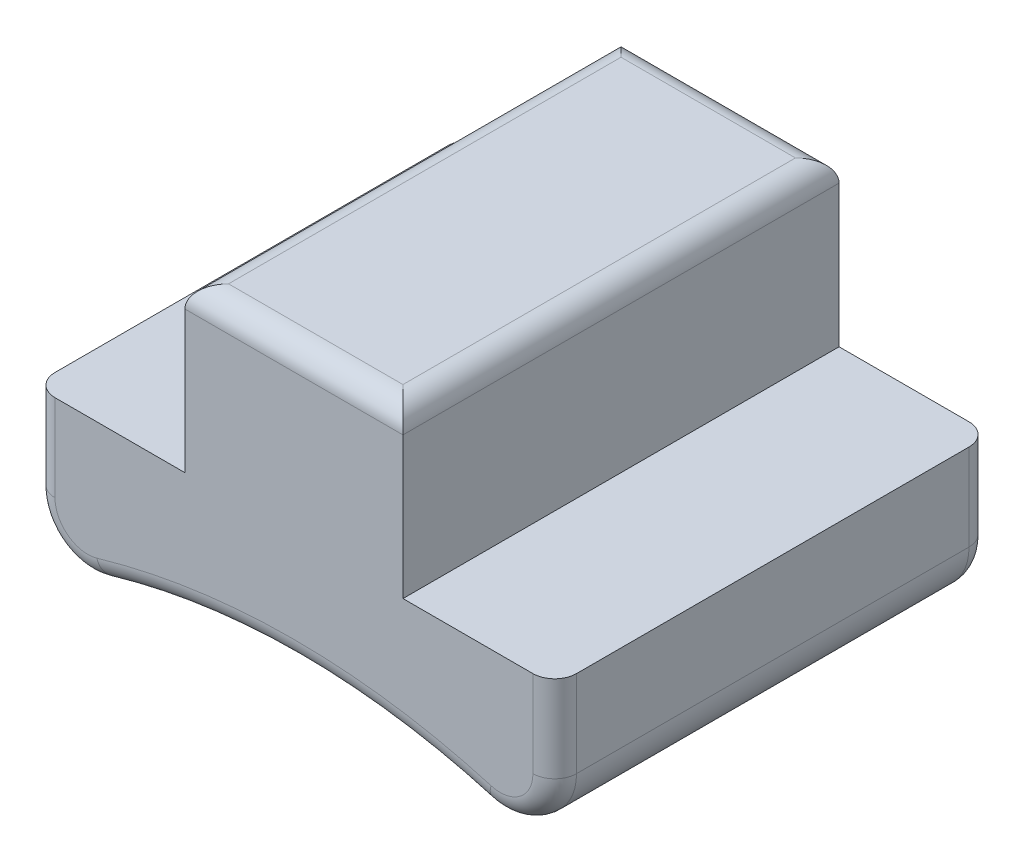
ISO-10303-21;
HEADER;
FILE_DESCRIPTION(('STEP AP214'),'2;1');
FILE_NAME('part.step','',(''),(''),'','','');
FILE_SCHEMA(('AUTOMOTIVE_DESIGN { 1 0 10303 214 1 1 1 1 }'));
ENDSEC;
DATA;
#1=APPLICATION_CONTEXT('core data for automotive mechanical design processes');
#2=APPLICATION_PROTOCOL_DEFINITION('international standard','automotive_design',2000,#1);
#3=PRODUCT_CONTEXT('',#1,'mechanical');
#4=PRODUCT('Part','Part','',(#3));
#5=PRODUCT_RELATED_PRODUCT_CATEGORY('part','',(#4));
#6=PRODUCT_DEFINITION_FORMATION('','',#4);
#7=PRODUCT_DEFINITION_CONTEXT('part definition',#1,'design');
#8=PRODUCT_DEFINITION('design','',#6,#7);
#9=PRODUCT_DEFINITION_SHAPE('','',#8);
#10=(LENGTH_UNIT() NAMED_UNIT(*) SI_UNIT(.MILLI.,.METRE.));
#11=(NAMED_UNIT(*) PLANE_ANGLE_UNIT() SI_UNIT($,.RADIAN.));
#12=(NAMED_UNIT(*) SI_UNIT($,.STERADIAN.) SOLID_ANGLE_UNIT());
#13=UNCERTAINTY_MEASURE_WITH_UNIT(LENGTH_MEASURE(1.E-05),#10,'distance_accuracy_value','');
#14=(GEOMETRIC_REPRESENTATION_CONTEXT(3) GLOBAL_UNCERTAINTY_ASSIGNED_CONTEXT((#13)) GLOBAL_UNIT_ASSIGNED_CONTEXT((#10,
#11,#12)) REPRESENTATION_CONTEXT('',''));
#15=CARTESIAN_POINT('',(0.,0.,0.));
#16=DIRECTION('',(0.,0.,1.));
#17=DIRECTION('',(1.,0.,0.));
#18=AXIS2_PLACEMENT_3D('',#15,#16,#17);
#19=CARTESIAN_POINT('',(-12.7,92.3829378930835,50.8));
#20=DIRECTION('',(0.,-1.,0.));
#21=DIRECTION('',(0.,0.,-1.));
#22=AXIS2_PLACEMENT_3D('',#19,#20,#21);
#23=PLANE('',#22);
#24=DIRECTION('',(-1.,0.,0.));
#25=VECTOR('',#24,1.);
#26=CARTESIAN_POINT('',(-12.7,92.3829378930835,0.));
#27=LINE('',#26,#25);
#28=CARTESIAN_POINT('',(-12.7,92.3829378930835,0.));
#29=VERTEX_POINT('',#28);
#30=CARTESIAN_POINT('',(-27.8354974439788,92.3829378930835,0.));
#31=VERTEX_POINT('',#30);
#32=EDGE_CURVE('E209',#29,#31,#27,.T.);
#33=ORIENTED_EDGE('',*,*,#32,.T.);
#34=CARTESIAN_POINT('',(-27.8354974439788,92.3829378930835,2.54));
#35=DIRECTION('',(0.,-1.,0.));
#36=DIRECTION('',(0.,0.,-1.));
#37=AXIS2_PLACEMENT_3D('',#34,#35,#36);
#38=CIRCLE('',#37,2.54);
#39=CARTESIAN_POINT('',(-30.3754974439788,92.3829378930835,2.54));
#40=VERTEX_POINT('',#39);
#41=EDGE_CURVE('E352',#31,#40,#38,.F.);
#42=ORIENTED_EDGE('',*,*,#41,.T.);
#43=DIRECTION('',(0.,0.,-1.));
#44=VECTOR('',#43,1.);
#45=CARTESIAN_POINT('',(-30.3754974439788,92.3829378930835,50.8));
#46=LINE('',#45,#44);
#47=CARTESIAN_POINT('',(-30.3754974439788,92.3829378930835,48.26));
#48=VERTEX_POINT('',#47);
#49=EDGE_CURVE('E227',#48,#40,#46,.T.);
#50=ORIENTED_EDGE('',*,*,#49,.F.);
#51=CARTESIAN_POINT('',(-27.8354974439788,92.3829378930835,48.26));
#52=DIRECTION('',(0.,-1.,0.));
#53=DIRECTION('',(0.,0.,-1.));
#54=AXIS2_PLACEMENT_3D('',#51,#52,#53);
#55=CIRCLE('',#54,2.54);
#56=CARTESIAN_POINT('',(-27.8354974439788,92.3829378930835,50.8));
#57=VERTEX_POINT('',#56);
#58=EDGE_CURVE('E299',#48,#57,#55,.F.);
#59=ORIENTED_EDGE('',*,*,#58,.T.);
#60=DIRECTION('',(-1.,0.,0.));
#61=VECTOR('',#60,1.);
#62=CARTESIAN_POINT('',(-12.7,92.3829378930835,50.8));
#63=LINE('',#62,#61);
#64=CARTESIAN_POINT('',(-12.7,92.3829378930835,50.8));
#65=VERTEX_POINT('',#64);
#66=EDGE_CURVE('E183',#65,#57,#63,.T.);
#67=ORIENTED_EDGE('',*,*,#66,.F.);
#68=DIRECTION('',(0.,0.,-1.));
#69=VECTOR('',#68,1.);
#70=CARTESIAN_POINT('',(-12.7,92.3829378930835,50.8));
#71=LINE('',#70,#69);
#72=EDGE_CURVE('E196',#65,#29,#71,.T.);
#73=ORIENTED_EDGE('',*,*,#72,.T.);
#74=EDGE_LOOP('',(#33,#42,#50,#59,#67,#73));
#75=FACE_BOUND('',#74,.T.);
#76=ADVANCED_FACE('F45',(#75),#23,.F.);
#77=CARTESIAN_POINT('',(-30.3754974439788,92.3829378930835,50.8));
#78=DIRECTION('',(1.,0.,0.));
#79=DIRECTION('',(0.,1.,0.));
#80=AXIS2_PLACEMENT_3D('',#77,#78,#79);
#81=PLANE('',#80);
#82=ORIENTED_EDGE('',*,*,#49,.T.);
#83=DIRECTION('',(0.,-1.,0.));
#84=VECTOR('',#83,1.);
#85=CARTESIAN_POINT('',(-30.3754974439788,92.3829378930835,2.54));
#86=LINE('',#85,#84);
#87=CARTESIAN_POINT('',(-30.3754974439788,82.2894349085553,2.54));
#88=VERTEX_POINT('',#87);
#89=EDGE_CURVE('E319',#40,#88,#86,.T.);
#90=ORIENTED_EDGE('',*,*,#89,.T.);
#91=DIRECTION('',(0.,0.,-1.));
#92=VECTOR('',#91,1.);
#93=CARTESIAN_POINT('',(-30.3754974439788,82.2894349085553,50.8));
#94=LINE('',#93,#92);
#95=CARTESIAN_POINT('',(-30.3754974439788,82.2894349085553,48.26));
#96=VERTEX_POINT('',#95);
#97=EDGE_CURVE('E237',#88,#96,#94,.F.);
#98=ORIENTED_EDGE('',*,*,#97,.T.);
#99=DIRECTION('',(0.,-1.,0.));
#100=VECTOR('',#99,1.);
#101=CARTESIAN_POINT('',(-30.3754974439788,92.3829378930835,48.26));
#102=LINE('',#101,#100);
#103=EDGE_CURVE('E296',#96,#48,#102,.F.);
#104=ORIENTED_EDGE('',*,*,#103,.T.);
#105=EDGE_LOOP('',(#82,#90,#98,#104));
#106=FACE_BOUND('',#105,.T.);
#107=ADVANCED_FACE('F421',(#106),#81,.F.);
#108=CARTESIAN_POINT('',(0.,0.,50.8));
#109=DIRECTION('',(0.,0.,-1.));
#110=DIRECTION('',(-1.,0.,0.));
#111=AXIS2_PLACEMENT_3D('',#108,#109,#110);
#112=CYLINDRICAL_SURFACE('',#111,79.375);
#113=DIRECTION('',(0.,0.,-1.));
#114=VECTOR('',#113,1.);
#115=CARTESIAN_POINT('',(-22.2458309666471,76.1939212116253,50.8));
#116=LINE('',#115,#114);
#117=CARTESIAN_POINT('',(-22.2458309666471,76.1939212116253,48.26));
#118=VERTEX_POINT('',#117);
#119=CARTESIAN_POINT('',(-22.2458309666471,76.1939212116253,2.54));
#120=VERTEX_POINT('',#119);
#121=EDGE_CURVE('E234',#118,#120,#116,.T.);
#122=ORIENTED_EDGE('',*,*,#121,.T.);
#123=CARTESIAN_POINT('',(0.,0.,2.54));
#124=DIRECTION('',(0.,0.,1.));
#125=DIRECTION('',(1.,0.,0.));
#126=AXIS2_PLACEMENT_3D('',#123,#124,#125);
#127=CIRCLE('',#126,79.375);
#128=CARTESIAN_POINT('',(22.2458309666471,76.1939212116253,2.54));
#129=VERTEX_POINT('',#128);
#130=EDGE_CURVE('E11',#120,#129,#127,.F.);
#131=ORIENTED_EDGE('',*,*,#130,.T.);
#132=DIRECTION('',(0.,0.,-1.));
#133=VECTOR('',#132,1.);
#134=CARTESIAN_POINT('',(22.2458309666471,76.1939212116253,50.8));
#135=LINE('',#134,#133);
#136=CARTESIAN_POINT('',(22.2458309666471,76.1939212116253,48.26));
#137=VERTEX_POINT('',#136);
#138=EDGE_CURVE('E231',#129,#137,#135,.F.);
#139=ORIENTED_EDGE('',*,*,#138,.T.);
#140=CARTESIAN_POINT('',(0.,0.,48.26));
#141=DIRECTION('',(0.,0.,1.));
#142=DIRECTION('',(1.,0.,0.));
#143=AXIS2_PLACEMENT_3D('',#140,#141,#142);
#144=CIRCLE('',#143,79.375);
#145=EDGE_CURVE('E316',#137,#118,#144,.T.);
#146=ORIENTED_EDGE('',*,*,#145,.T.);
#147=EDGE_LOOP('',(#122,#131,#139,#146));
#148=FACE_BOUND('',#147,.T.);
#149=ADVANCED_FACE('F408',(#148),#112,.F.);
#150=CARTESIAN_POINT('',(30.3754974439788,92.3829378930835,50.8));
#151=DIRECTION('',(-1.,0.,0.));
#152=DIRECTION('',(0.,-1.,0.));
#153=AXIS2_PLACEMENT_3D('',#150,#151,#152);
#154=PLANE('',#153);
#155=DIRECTION('',(0.,0.,-1.));
#156=VECTOR('',#155,1.);
#157=CARTESIAN_POINT('',(30.3754974439788,82.2894349085553,50.8));
#158=LINE('',#157,#156);
#159=CARTESIAN_POINT('',(30.3754974439788,82.2894349085553,48.26));
#160=VERTEX_POINT('',#159);
#161=CARTESIAN_POINT('',(30.3754974439788,82.2894349085553,2.54));
#162=VERTEX_POINT('',#161);
#163=EDGE_CURVE('E240',#160,#162,#158,.T.);
#164=ORIENTED_EDGE('',*,*,#163,.T.);
#165=DIRECTION('',(0.,1.,0.));
#166=VECTOR('',#165,1.);
#167=CARTESIAN_POINT('',(30.3754974439788,92.3829378930835,2.54));
#168=LINE('',#167,#166);
#169=CARTESIAN_POINT('',(30.3754974439788,92.3829378930835,2.54));
#170=VERTEX_POINT('',#169);
#171=EDGE_CURVE('E358',#162,#170,#168,.T.);
#172=ORIENTED_EDGE('',*,*,#171,.T.);
#173=DIRECTION('',(0.,0.,-1.));
#174=VECTOR('',#173,1.);
#175=CARTESIAN_POINT('',(30.3754974439788,92.3829378930835,50.8));
#176=LINE('',#175,#174);
#177=CARTESIAN_POINT('',(30.3754974439788,92.3829378930835,48.26));
#178=VERTEX_POINT('',#177);
#179=EDGE_CURVE('E195',#178,#170,#176,.T.);
#180=ORIENTED_EDGE('',*,*,#179,.F.);
#181=DIRECTION('',(0.,1.,0.));
#182=VECTOR('',#181,1.);
#183=CARTESIAN_POINT('',(30.3754974439788,82.2894349085553,48.26));
#184=LINE('',#183,#182);
#185=EDGE_CURVE('E309',#178,#160,#184,.F.);
#186=ORIENTED_EDGE('',*,*,#185,.T.);
#187=EDGE_LOOP('',(#164,#172,#180,#186));
#188=FACE_BOUND('',#187,.T.);
#189=ADVANCED_FACE('F390',(#188),#154,.F.);
#190=CARTESIAN_POINT('',(12.7,92.3829378930835,50.8));
#191=DIRECTION('',(0.,-1.,0.));
#192=DIRECTION('',(0.,0.,-1.));
#193=AXIS2_PLACEMENT_3D('',#190,#191,#192);
#194=PLANE('',#193);
#195=ORIENTED_EDGE('',*,*,#179,.T.);
#196=CARTESIAN_POINT('',(27.8354974439788,92.3829378930835,2.54));
#197=DIRECTION('',(0.,-1.,0.));
#198=DIRECTION('',(0.,0.,-1.));
#199=AXIS2_PLACEMENT_3D('',#196,#197,#198);
#200=CIRCLE('',#199,2.54);
#201=CARTESIAN_POINT('',(27.8354974439788,92.3829378930835,0.));
#202=VERTEX_POINT('',#201);
#203=EDGE_CURVE('E361',#170,#202,#200,.F.);
#204=ORIENTED_EDGE('',*,*,#203,.T.);
#205=DIRECTION('',(-1.,0.,0.));
#206=VECTOR('',#205,1.);
#207=CARTESIAN_POINT('',(12.7,92.3829378930835,0.));
#208=LINE('',#207,#206);
#209=CARTESIAN_POINT('',(12.7,92.3829378930835,0.));
#210=VERTEX_POINT('',#209);
#211=EDGE_CURVE('E190',#202,#210,#208,.T.);
#212=ORIENTED_EDGE('',*,*,#211,.T.);
#213=DIRECTION('',(0.,0.,-1.));
#214=VECTOR('',#213,1.);
#215=CARTESIAN_POINT('',(12.7,92.3829378930835,50.8));
#216=LINE('',#215,#214);
#217=CARTESIAN_POINT('',(12.7,92.3829378930835,50.8));
#218=VERTEX_POINT('',#217);
#219=EDGE_CURVE('E186',#218,#210,#216,.T.);
#220=ORIENTED_EDGE('',*,*,#219,.F.);
#221=DIRECTION('',(-1.,0.,0.));
#222=VECTOR('',#221,1.);
#223=CARTESIAN_POINT('',(12.7,92.3829378930835,50.8));
#224=LINE('',#223,#222);
#225=CARTESIAN_POINT('',(27.8354974439788,92.3829378930835,50.8));
#226=VERTEX_POINT('',#225);
#227=EDGE_CURVE('E172',#226,#218,#224,.T.);
#228=ORIENTED_EDGE('',*,*,#227,.F.);
#229=CARTESIAN_POINT('',(27.8354974439788,92.3829378930835,48.26));
#230=DIRECTION('',(0.,-1.,0.));
#231=DIRECTION('',(0.,0.,-1.));
#232=AXIS2_PLACEMENT_3D('',#229,#230,#231);
#233=CIRCLE('',#232,2.54);
#234=EDGE_CURVE('E306',#226,#178,#233,.F.);
#235=ORIENTED_EDGE('',*,*,#234,.T.);
#236=EDGE_LOOP('',(#195,#204,#212,#220,#228,#235));
#237=FACE_BOUND('',#236,.T.);
#238=ADVANCED_FACE('F188',(#237),#194,.F.);
#239=CARTESIAN_POINT('',(12.7,111.432937893083,50.8));
#240=DIRECTION('',(-1.,0.,0.));
#241=DIRECTION('',(0.,-1.,0.));
#242=AXIS2_PLACEMENT_3D('',#239,#240,#241);
#243=PLANE('',#242);
#244=DIRECTION('',(0.,1.,0.));
#245=VECTOR('',#244,1.);
#246=CARTESIAN_POINT('',(12.7,111.432937893083,0.));
#247=LINE('',#246,#245);
#248=CARTESIAN_POINT('',(12.7,108.892937893083,0.));
#249=VERTEX_POINT('',#248);
#250=EDGE_CURVE('E216',#210,#249,#247,.T.);
#251=ORIENTED_EDGE('',*,*,#250,.T.);
#252=DIRECTION('',(0.,0.,-1.));
#253=VECTOR('',#252,1.);
#254=CARTESIAN_POINT('',(12.7,108.892937893083,50.8));
#255=LINE('',#254,#253);
#256=CARTESIAN_POINT('',(12.7,108.892937893083,50.8));
#257=VERTEX_POINT('',#256);
#258=EDGE_CURVE('E201',#249,#257,#255,.F.);
#259=ORIENTED_EDGE('',*,*,#258,.T.);
#260=DIRECTION('',(0.,1.,0.));
#261=VECTOR('',#260,1.);
#262=CARTESIAN_POINT('',(12.7,111.432937893083,50.8));
#263=LINE('',#262,#261);
#264=EDGE_CURVE('E177',#218,#257,#263,.T.);
#265=ORIENTED_EDGE('',*,*,#264,.F.);
#266=ORIENTED_EDGE('',*,*,#219,.T.);
#267=EDGE_LOOP('',(#251,#259,#265,#266));
#268=FACE_BOUND('',#267,.T.);
#269=ADVANCED_FACE('F199',(#268),#243,.F.);
#270=CARTESIAN_POINT('',(-12.7,111.432937893083,50.8));
#271=DIRECTION('',(0.,-1.,0.));
#272=DIRECTION('',(0.,0.,-1.));
#273=AXIS2_PLACEMENT_3D('',#270,#271,#272);
#274=PLANE('',#273);
#275=DIRECTION('',(-1.,0.,0.));
#276=VECTOR('',#275,1.);
#277=CARTESIAN_POINT('',(12.7,111.432937893083,48.26));
#278=LINE('',#277,#276);
#279=CARTESIAN_POINT('',(-10.16,111.432937893083,48.26));
#280=VERTEX_POINT('',#279);
#281=CARTESIAN_POINT('',(10.16,111.432937893083,48.26));
#282=VERTEX_POINT('',#281);
#283=EDGE_CURVE('E249',#280,#282,#278,.F.);
#284=ORIENTED_EDGE('',*,*,#283,.T.);
#285=DIRECTION('',(0.,0.,-1.));
#286=VECTOR('',#285,1.);
#287=CARTESIAN_POINT('',(10.16,111.432937893083,50.8));
#288=LINE('',#287,#286);
#289=CARTESIAN_POINT('',(10.16,111.432937893083,2.54));
#290=VERTEX_POINT('',#289);
#291=EDGE_CURVE('E252',#282,#290,#288,.T.);
#292=ORIENTED_EDGE('',*,*,#291,.T.);
#293=DIRECTION('',(-1.,0.,0.));
#294=VECTOR('',#293,1.);
#295=CARTESIAN_POINT('',(-12.7,111.432937893083,2.54));
#296=LINE('',#295,#294);
#297=CARTESIAN_POINT('',(-10.16,111.432937893083,2.54));
#298=VERTEX_POINT('',#297);
#299=EDGE_CURVE('E243',#290,#298,#296,.T.);
#300=ORIENTED_EDGE('',*,*,#299,.T.);
#301=DIRECTION('',(0.,0.,-1.));
#302=VECTOR('',#301,1.);
#303=CARTESIAN_POINT('',(-10.16,111.432937893083,50.8));
#304=LINE('',#303,#302);
#305=EDGE_CURVE('E246',#298,#280,#304,.F.);
#306=ORIENTED_EDGE('',*,*,#305,.T.);
#307=EDGE_LOOP('',(#284,#292,#300,#306));
#308=FACE_BOUND('',#307,.T.);
#309=ADVANCED_FACE('F703',(#308),#274,.F.);
#310=CARTESIAN_POINT('',(-12.7,111.432937893083,50.8));
#311=DIRECTION('',(1.,0.,0.));
#312=DIRECTION('',(0.,1.,0.));
#313=AXIS2_PLACEMENT_3D('',#310,#311,#312);
#314=PLANE('',#313);
#315=DIRECTION('',(0.,-1.,0.));
#316=VECTOR('',#315,1.);
#317=CARTESIAN_POINT('',(-12.7,111.432937893083,50.8));
#318=LINE('',#317,#316);
#319=CARTESIAN_POINT('',(-12.7,108.892937893083,50.8));
#320=VERTEX_POINT('',#319);
#321=EDGE_CURVE('E203',#320,#65,#318,.T.);
#322=ORIENTED_EDGE('',*,*,#321,.F.);
#323=DIRECTION('',(0.,0.,-1.));
#324=VECTOR('',#323,1.);
#325=CARTESIAN_POINT('',(-12.7,108.892937893083,50.8));
#326=LINE('',#325,#324);
#327=CARTESIAN_POINT('',(-12.7,108.892937893083,0.));
#328=VERTEX_POINT('',#327);
#329=EDGE_CURVE('E261',#320,#328,#326,.T.);
#330=ORIENTED_EDGE('',*,*,#329,.T.);
#331=DIRECTION('',(0.,-1.,0.));
#332=VECTOR('',#331,1.);
#333=CARTESIAN_POINT('',(-12.7,111.432937893083,0.));
#334=LINE('',#333,#332);
#335=EDGE_CURVE('E219',#328,#29,#334,.T.);
#336=ORIENTED_EDGE('',*,*,#335,.T.);
#337=ORIENTED_EDGE('',*,*,#72,.F.);
#338=EDGE_LOOP('',(#322,#330,#336,#337));
#339=FACE_BOUND('',#338,.T.);
#340=ADVANCED_FACE('F436',(#339),#314,.F.);
#341=CARTESIAN_POINT('',(0.,0.,50.8));
#342=DIRECTION('',(0.,0.,1.));
#343=DIRECTION('',(1.,0.,0.));
#344=AXIS2_PLACEMENT_3D('',#341,#342,#343);
#345=PLANE('',#344);
#346=ORIENTED_EDGE('',*,*,#66,.T.);
#347=DIRECTION('',(0.,-1.,0.));
#348=VECTOR('',#347,1.);
#349=CARTESIAN_POINT('',(-27.8354974439788,82.2894349085553,50.8));
#350=LINE('',#349,#348);
#351=CARTESIAN_POINT('',(-27.8354974439788,82.2894349085553,50.8));
#352=VERTEX_POINT('',#351);
#353=EDGE_CURVE('E292',#57,#352,#350,.T.);
#354=ORIENTED_EDGE('',*,*,#353,.T.);
#355=CARTESIAN_POINT('',(-24.0254974439788,82.2894349085553,50.8));
#356=DIRECTION('',(0.,0.,1.));
#357=DIRECTION('',(1.,0.,0.));
#358=AXIS2_PLACEMENT_3D('',#355,#356,#357);
#359=CIRCLE('',#358,3.81);
#360=CARTESIAN_POINT('',(-22.9576975575798,78.6321266903973,50.8));
#361=VERTEX_POINT('',#360);
#362=EDGE_CURVE('E289',#352,#361,#359,.T.);
#363=ORIENTED_EDGE('',*,*,#362,.T.);
#364=CARTESIAN_POINT('',(0.,0.,50.8));
#365=DIRECTION('',(0.,0.,1.));
#366=DIRECTION('',(1.,0.,0.));
#367=AXIS2_PLACEMENT_3D('',#364,#365,#366);
#368=CIRCLE('',#367,81.915);
#369=CARTESIAN_POINT('',(22.9576975575798,78.6321266903973,50.8));
#370=VERTEX_POINT('',#369);
#371=EDGE_CURVE('E267',#361,#370,#368,.F.);
#372=ORIENTED_EDGE('',*,*,#371,.T.);
#373=CARTESIAN_POINT('',(24.0254974439788,82.2894349085553,50.8));
#374=DIRECTION('',(0.,0.,1.));
#375=DIRECTION('',(1.,0.,0.));
#376=AXIS2_PLACEMENT_3D('',#373,#374,#375);
#377=CIRCLE('',#376,3.81);
#378=CARTESIAN_POINT('',(27.8354974439788,82.2894349085553,50.8));
#379=VERTEX_POINT('',#378);
#380=EDGE_CURVE('E284',#370,#379,#377,.T.);
#381=ORIENTED_EDGE('',*,*,#380,.T.);
#382=DIRECTION('',(0.,1.,0.));
#383=VECTOR('',#382,1.);
#384=CARTESIAN_POINT('',(27.8354974439788,92.3829378930835,50.8));
#385=LINE('',#384,#383);
#386=EDGE_CURVE('E179',#379,#226,#385,.T.);
#387=ORIENTED_EDGE('',*,*,#386,.T.);
#388=ORIENTED_EDGE('',*,*,#227,.T.);
#389=ORIENTED_EDGE('',*,*,#264,.T.);
#390=DIRECTION('',(-1.,0.,0.));
#391=VECTOR('',#390,1.);
#392=CARTESIAN_POINT('',(-12.7,108.892937893083,50.8));
#393=LINE('',#392,#391);
#394=EDGE_CURVE('E258',#257,#320,#393,.T.);
#395=ORIENTED_EDGE('',*,*,#394,.T.);
#396=ORIENTED_EDGE('',*,*,#321,.T.);
#397=EDGE_LOOP('',(#346,#354,#363,#372,#381,#387,#388,#389,#395,#396));
#398=FACE_BOUND('',#397,.T.);
#399=ADVANCED_FACE('F175',(#398),#345,.T.);
#400=CARTESIAN_POINT('',(0.,0.,0.));
#401=DIRECTION('',(0.,0.,1.));
#402=DIRECTION('',(1.,0.,0.));
#403=AXIS2_PLACEMENT_3D('',#400,#401,#402);
#404=PLANE('',#403);
#405=CARTESIAN_POINT('',(-24.0254974439788,82.2894349085553,0.));
#406=DIRECTION('',(0.,0.,1.));
#407=DIRECTION('',(1.,0.,0.));
#408=AXIS2_PLACEMENT_3D('',#405,#406,#407);
#409=CIRCLE('',#408,3.81);
#410=CARTESIAN_POINT('',(-22.9576975575798,78.6321266903973,0.));
#411=VERTEX_POINT('',#410);
#412=CARTESIAN_POINT('',(-27.8354974439788,82.2894349085553,0.));
#413=VERTEX_POINT('',#412);
#414=EDGE_CURVE('E346',#411,#413,#409,.F.);
#415=ORIENTED_EDGE('',*,*,#414,.T.);
#416=DIRECTION('',(0.,-1.,0.));
#417=VECTOR('',#416,1.);
#418=CARTESIAN_POINT('',(-27.8354974439786,0.,0.));
#419=LINE('',#418,#417);
#420=EDGE_CURVE('E349',#413,#31,#419,.F.);
#421=ORIENTED_EDGE('',*,*,#420,.T.);
#422=ORIENTED_EDGE('',*,*,#32,.F.);
#423=ORIENTED_EDGE('',*,*,#335,.F.);
#424=DIRECTION('',(-1.,0.,0.));
#425=VECTOR('',#424,1.);
#426=CARTESIAN_POINT('',(0.,108.892937893083,0.));
#427=LINE('',#426,#425);
#428=EDGE_CURVE('E264',#328,#249,#427,.F.);
#429=ORIENTED_EDGE('',*,*,#428,.T.);
#430=ORIENTED_EDGE('',*,*,#250,.F.);
#431=ORIENTED_EDGE('',*,*,#211,.F.);
#432=DIRECTION('',(0.,1.,0.));
#433=VECTOR('',#432,1.);
#434=CARTESIAN_POINT('',(27.8354974439786,0.,0.));
#435=LINE('',#434,#433);
#436=CARTESIAN_POINT('',(27.8354974439788,82.2894349085553,0.));
#437=VERTEX_POINT('',#436);
#438=EDGE_CURVE('E343',#202,#437,#435,.F.);
#439=ORIENTED_EDGE('',*,*,#438,.T.);
#440=CARTESIAN_POINT('',(24.0254974439788,82.2894349085553,0.));
#441=DIRECTION('',(0.,0.,1.));
#442=DIRECTION('',(1.,0.,0.));
#443=AXIS2_PLACEMENT_3D('',#440,#441,#442);
#444=CIRCLE('',#443,3.81);
#445=CARTESIAN_POINT('',(22.9576975575798,78.6321266903973,0.));
#446=VERTEX_POINT('',#445);
#447=EDGE_CURVE('E340',#437,#446,#444,.F.);
#448=ORIENTED_EDGE('',*,*,#447,.T.);
#449=CARTESIAN_POINT('',(0.,0.,0.));
#450=DIRECTION('',(0.,0.,1.));
#451=DIRECTION('',(1.,0.,0.));
#452=AXIS2_PLACEMENT_3D('',#449,#450,#451);
#453=CIRCLE('',#452,81.915);
#454=EDGE_CURVE('E337',#446,#411,#453,.T.);
#455=ORIENTED_EDGE('',*,*,#454,.T.);
#456=EDGE_LOOP('',(#415,#421,#422,#423,#429,#430,#431,#439,#448,#455));
#457=FACE_BOUND('',#456,.T.);
#458=ADVANCED_FACE('F429',(#457),#404,.F.);
#459=CARTESIAN_POINT('',(-24.0254974439788,82.2894349085553,50.8));
#460=DIRECTION('',(0.,0.,-1.));
#461=DIRECTION('',(-1.,0.,0.));
#462=AXIS2_PLACEMENT_3D('',#459,#460,#461);
#463=CYLINDRICAL_SURFACE('',#462,6.35);
#464=ORIENTED_EDGE('',*,*,#97,.F.);
#465=CARTESIAN_POINT('',(-24.0254974439788,82.2894349085553,2.54));
#466=DIRECTION('',(0.,0.,1.));
#467=DIRECTION('',(1.,0.,0.));
#468=AXIS2_PLACEMENT_3D('',#465,#466,#467);
#469=CIRCLE('',#468,6.35);
#470=EDGE_CURVE('E355',#88,#120,#469,.T.);
#471=ORIENTED_EDGE('',*,*,#470,.T.);
#472=ORIENTED_EDGE('',*,*,#121,.F.);
#473=CARTESIAN_POINT('',(-24.0254974439788,82.2894349085553,48.26));
#474=DIRECTION('',(0.,0.,1.));
#475=DIRECTION('',(1.,0.,0.));
#476=AXIS2_PLACEMENT_3D('',#473,#474,#475);
#477=CIRCLE('',#476,6.35);
#478=EDGE_CURVE('E302',#118,#96,#477,.F.);
#479=ORIENTED_EDGE('',*,*,#478,.T.);
#480=EDGE_LOOP('',(#464,#471,#472,#479));
#481=FACE_BOUND('',#480,.T.);
#482=ADVANCED_FACE('F411',(#481),#463,.T.);
#483=CARTESIAN_POINT('',(24.0254974439788,82.2894349085553,50.8));
#484=DIRECTION('',(0.,0.,-1.));
#485=DIRECTION('',(-1.,0.,0.));
#486=AXIS2_PLACEMENT_3D('',#483,#484,#485);
#487=CYLINDRICAL_SURFACE('',#486,6.35);
#488=ORIENTED_EDGE('',*,*,#138,.F.);
#489=CARTESIAN_POINT('',(24.0254974439788,82.2894349085553,2.54));
#490=DIRECTION('',(0.,0.,1.));
#491=DIRECTION('',(1.,0.,0.));
#492=AXIS2_PLACEMENT_3D('',#489,#490,#491);
#493=CIRCLE('',#492,6.35);
#494=EDGE_CURVE('E55',#129,#162,#493,.T.);
#495=ORIENTED_EDGE('',*,*,#494,.T.);
#496=ORIENTED_EDGE('',*,*,#163,.F.);
#497=CARTESIAN_POINT('',(24.0254974439788,82.2894349085553,48.26));
#498=DIRECTION('',(0.,0.,1.));
#499=DIRECTION('',(1.,0.,0.));
#500=AXIS2_PLACEMENT_3D('',#497,#498,#499);
#501=CIRCLE('',#500,6.35);
#502=EDGE_CURVE('E312',#160,#137,#501,.F.);
#503=ORIENTED_EDGE('',*,*,#502,.T.);
#504=EDGE_LOOP('',(#488,#495,#496,#503));
#505=FACE_BOUND('',#504,.T.);
#506=ADVANCED_FACE('F396',(#505),#487,.T.);
#507=CARTESIAN_POINT('',(-10.16,108.892937893083,50.8));
#508=DIRECTION('',(0.,0.,-1.));
#509=DIRECTION('',(-1.,0.,0.));
#510=AXIS2_PLACEMENT_3D('',#507,#508,#509);
#511=CYLINDRICAL_SURFACE('',#510,2.54);
#512=CARTESIAN_POINT('',(-10.16,108.892937893083,2.54));
#513=DIRECTION('',(-0.707106781186547,0.,0.707106781186547));
#514=DIRECTION('',(-0.707106781186547,0.,-0.707106781186547));
#515=AXIS2_PLACEMENT_3D('',#512,#513,#514);
#516=ELLIPSE('',#515,3.59210244842766,2.54);
#517=EDGE_CURVE('E275',#328,#298,#516,.F.);
#518=ORIENTED_EDGE('',*,*,#517,.F.);
#519=ORIENTED_EDGE('',*,*,#329,.F.);
#520=CARTESIAN_POINT('',(-10.16,108.892937893083,48.26));
#521=DIRECTION('',(-0.707106781186547,0.,-0.707106781186547));
#522=DIRECTION('',(0.707106781186547,0.,-0.707106781186547));
#523=AXIS2_PLACEMENT_3D('',#520,#521,#522);
#524=ELLIPSE('',#523,3.59210244842766,2.54);
#525=EDGE_CURVE('E213',#280,#320,#524,.F.);
#526=ORIENTED_EDGE('',*,*,#525,.F.);
#527=ORIENTED_EDGE('',*,*,#305,.F.);
#528=EDGE_LOOP('',(#518,#519,#526,#527));
#529=FACE_BOUND('',#528,.T.);
#530=ADVANCED_FACE('F442',(#529),#511,.T.);
#531=CARTESIAN_POINT('',(0.,108.892937893083,48.26));
#532=DIRECTION('',(1.,0.,0.));
#533=DIRECTION('',(0.,0.,-1.));
#534=AXIS2_PLACEMENT_3D('',#531,#532,#533);
#535=CYLINDRICAL_SURFACE('',#534,2.54);
#536=ORIENTED_EDGE('',*,*,#525,.T.);
#537=ORIENTED_EDGE('',*,*,#394,.F.);
#538=CARTESIAN_POINT('',(10.16,108.892937893083,48.26));
#539=DIRECTION('',(0.707106781186547,0.,-0.707106781186547));
#540=DIRECTION('',(0.707106781186547,0.,0.707106781186547));
#541=AXIS2_PLACEMENT_3D('',#538,#539,#540);
#542=ELLIPSE('',#541,3.59210244842766,2.54);
#543=EDGE_CURVE('E271',#282,#257,#542,.T.);
#544=ORIENTED_EDGE('',*,*,#543,.F.);
#545=ORIENTED_EDGE('',*,*,#283,.F.);
#546=EDGE_LOOP('',(#536,#537,#544,#545));
#547=FACE_BOUND('',#546,.T.);
#548=ADVANCED_FACE('F455',(#547),#535,.T.);
#549=CARTESIAN_POINT('',(-12.7,108.892937893083,2.54));
#550=DIRECTION('',(-1.,0.,0.));
#551=DIRECTION('',(0.,0.,1.));
#552=AXIS2_PLACEMENT_3D('',#549,#550,#551);
#553=CYLINDRICAL_SURFACE('',#552,2.54);
#554=ORIENTED_EDGE('',*,*,#517,.T.);
#555=ORIENTED_EDGE('',*,*,#299,.F.);
#556=CARTESIAN_POINT('',(10.16,108.892937893083,2.54));
#557=DIRECTION('',(-0.707106781186547,0.,-0.707106781186547));
#558=DIRECTION('',(-0.707106781186547,0.,0.707106781186547));
#559=AXIS2_PLACEMENT_3D('',#556,#557,#558);
#560=ELLIPSE('',#559,3.59210244842766,2.54);
#561=EDGE_CURVE('E268',#249,#290,#560,.F.);
#562=ORIENTED_EDGE('',*,*,#561,.F.);
#563=ORIENTED_EDGE('',*,*,#428,.F.);
#564=EDGE_LOOP('',(#554,#555,#562,#563));
#565=FACE_BOUND('',#564,.T.);
#566=ADVANCED_FACE('F447',(#565),#553,.T.);
#567=CARTESIAN_POINT('',(10.16,108.892937893083,50.8));
#568=DIRECTION('',(0.,0.,-1.));
#569=DIRECTION('',(-1.,0.,0.));
#570=AXIS2_PLACEMENT_3D('',#567,#568,#569);
#571=CYLINDRICAL_SURFACE('',#570,2.54);
#572=ORIENTED_EDGE('',*,*,#543,.T.);
#573=ORIENTED_EDGE('',*,*,#258,.F.);
#574=ORIENTED_EDGE('',*,*,#561,.T.);
#575=ORIENTED_EDGE('',*,*,#291,.F.);
#576=EDGE_LOOP('',(#572,#573,#574,#575));
#577=FACE_BOUND('',#576,.T.);
#578=ADVANCED_FACE('F450',(#577),#571,.T.);
#579=CARTESIAN_POINT('',(27.8354974439786,0.,48.26));
#580=DIRECTION('',(0.,-1.,0.));
#581=DIRECTION('',(1.,0.,0.));
#582=AXIS2_PLACEMENT_3D('',#579,#580,#581);
#583=CYLINDRICAL_SURFACE('',#582,2.54);
#584=ORIENTED_EDGE('',*,*,#234,.F.);
#585=ORIENTED_EDGE('',*,*,#386,.F.);
#586=CARTESIAN_POINT('',(27.8354974439788,82.2894349085553,48.26));
#587=DIRECTION('',(0.,-1.,0.));
#588=DIRECTION('',(0.,0.,-1.));
#589=AXIS2_PLACEMENT_3D('',#586,#587,#588);
#590=CIRCLE('',#589,2.54);
#591=EDGE_CURVE('E272',#160,#379,#590,.T.);
#592=ORIENTED_EDGE('',*,*,#591,.F.);
#593=ORIENTED_EDGE('',*,*,#185,.F.);
#594=EDGE_LOOP('',(#584,#585,#592,#593));
#595=FACE_BOUND('',#594,.T.);
#596=ADVANCED_FACE('F393',(#595),#583,.T.);
#597=CARTESIAN_POINT('',(24.0254974439788,82.2894349085553,48.26));
#598=DIRECTION('',(0.,0.,1.));
#599=DIRECTION('',(1.,0.,0.));
#600=AXIS2_PLACEMENT_3D('',#597,#598,#599);
#601=TOROIDAL_SURFACE('',#600,3.81,2.54);
#602=ORIENTED_EDGE('',*,*,#591,.T.);
#603=ORIENTED_EDGE('',*,*,#380,.F.);
#604=CARTESIAN_POINT('',(22.9576975575798,78.6321266903973,48.26));
#605=DIRECTION('',(-0.959923416839374,0.280262437375081,0.));
#606=DIRECTION('',(-0.280262437375081,-0.959923416839374,0.));
#607=AXIS2_PLACEMENT_3D('',#604,#605,#606);
#608=CIRCLE('',#607,2.54);
#609=EDGE_CURVE('E327',#137,#370,#608,.T.);
#610=ORIENTED_EDGE('',*,*,#609,.F.);
#611=ORIENTED_EDGE('',*,*,#502,.F.);
#612=EDGE_LOOP('',(#602,#603,#610,#611));
#613=FACE_BOUND('',#612,.T.);
#614=ADVANCED_FACE('F401',(#613),#601,.T.);
#615=CARTESIAN_POINT('',(0.,0.,48.26));
#616=DIRECTION('',(0.,0.,1.));
#617=DIRECTION('',(1.,0.,0.));
#618=AXIS2_PLACEMENT_3D('',#615,#616,#617);
#619=TOROIDAL_SURFACE('',#618,81.915,2.54);
#620=ORIENTED_EDGE('',*,*,#609,.T.);
#621=ORIENTED_EDGE('',*,*,#371,.F.);
#622=CARTESIAN_POINT('',(-22.9576975575798,78.6321266903973,48.26));
#623=DIRECTION('',(-0.959923416839374,-0.280262437375082,0.));
#624=DIRECTION('',(0.280262437375082,-0.959923416839374,0.));
#625=AXIS2_PLACEMENT_3D('',#622,#623,#624);
#626=CIRCLE('',#625,2.54);
#627=EDGE_CURVE('E323',#118,#361,#626,.T.);
#628=ORIENTED_EDGE('',*,*,#627,.F.);
#629=ORIENTED_EDGE('',*,*,#145,.F.);
#630=EDGE_LOOP('',(#620,#621,#628,#629));
#631=FACE_BOUND('',#630,.T.);
#632=ADVANCED_FACE('F405',(#631),#619,.T.);
#633=CARTESIAN_POINT('',(-24.0254974439788,82.2894349085553,48.26));
#634=DIRECTION('',(0.,0.,1.));
#635=DIRECTION('',(1.,0.,0.));
#636=AXIS2_PLACEMENT_3D('',#633,#634,#635);
#637=TOROIDAL_SURFACE('',#636,3.81,2.54);
#638=ORIENTED_EDGE('',*,*,#627,.T.);
#639=ORIENTED_EDGE('',*,*,#362,.F.);
#640=CARTESIAN_POINT('',(-27.8354974439788,82.2894349085553,48.26));
#641=DIRECTION('',(0.,1.,0.));
#642=DIRECTION('',(0.,0.,1.));
#643=AXIS2_PLACEMENT_3D('',#640,#641,#642);
#644=CIRCLE('',#643,2.54);
#645=EDGE_CURVE('E320',#96,#352,#644,.T.);
#646=ORIENTED_EDGE('',*,*,#645,.F.);
#647=ORIENTED_EDGE('',*,*,#478,.F.);
#648=EDGE_LOOP('',(#638,#639,#646,#647));
#649=FACE_BOUND('',#648,.T.);
#650=ADVANCED_FACE('F464',(#649),#637,.T.);
#651=CARTESIAN_POINT('',(-27.8354974439786,0.,48.26));
#652=DIRECTION('',(0.,1.,0.));
#653=DIRECTION('',(-1.,0.,0.));
#654=AXIS2_PLACEMENT_3D('',#651,#652,#653);
#655=CYLINDRICAL_SURFACE('',#654,2.54);
#656=ORIENTED_EDGE('',*,*,#58,.F.);
#657=ORIENTED_EDGE('',*,*,#103,.F.);
#658=ORIENTED_EDGE('',*,*,#645,.T.);
#659=ORIENTED_EDGE('',*,*,#353,.F.);
#660=EDGE_LOOP('',(#656,#657,#658,#659));
#661=FACE_BOUND('',#660,.T.);
#662=ADVANCED_FACE('F460',(#661),#655,.T.);
#663=CARTESIAN_POINT('',(27.8354974439788,92.3829378930835,2.54));
#664=DIRECTION('',(0.,1.,0.));
#665=DIRECTION('',(-1.,0.,0.));
#666=AXIS2_PLACEMENT_3D('',#663,#664,#665);
#667=CYLINDRICAL_SURFACE('',#666,2.54);
#668=ORIENTED_EDGE('',*,*,#203,.F.);
#669=ORIENTED_EDGE('',*,*,#171,.F.);
#670=CARTESIAN_POINT('',(27.8354974439788,82.2894349085553,2.54));
#671=DIRECTION('',(0.,-1.,0.));
#672=DIRECTION('',(0.,0.,-1.));
#673=AXIS2_PLACEMENT_3D('',#670,#671,#672);
#674=CIRCLE('',#673,2.54);
#675=EDGE_CURVE('E49',#437,#162,#674,.T.);
#676=ORIENTED_EDGE('',*,*,#675,.F.);
#677=ORIENTED_EDGE('',*,*,#438,.F.);
#678=EDGE_LOOP('',(#668,#669,#676,#677));
#679=FACE_BOUND('',#678,.T.);
#680=ADVANCED_FACE('F47',(#679),#667,.T.);
#681=CARTESIAN_POINT('',(24.0254974439788,82.2894349085553,2.54));
#682=DIRECTION('',(0.,0.,1.));
#683=DIRECTION('',(1.,0.,0.));
#684=AXIS2_PLACEMENT_3D('',#681,#682,#683);
#685=TOROIDAL_SURFACE('',#684,3.81,2.54);
#686=ORIENTED_EDGE('',*,*,#675,.T.);
#687=ORIENTED_EDGE('',*,*,#494,.F.);
#688=CARTESIAN_POINT('',(22.9576975575798,78.6321266903973,2.54));
#689=DIRECTION('',(-0.959923416839374,0.280262437375082,0.));
#690=DIRECTION('',(-0.280262437375082,-0.959923416839374,0.));
#691=AXIS2_PLACEMENT_3D('',#688,#689,#690);
#692=CIRCLE('',#691,2.54);
#693=EDGE_CURVE('E372',#446,#129,#692,.T.);
#694=ORIENTED_EDGE('',*,*,#693,.F.);
#695=ORIENTED_EDGE('',*,*,#447,.F.);
#696=EDGE_LOOP('',(#686,#687,#694,#695));
#697=FACE_BOUND('',#696,.T.);
#698=ADVANCED_FACE('F383',(#697),#685,.T.);
#699=CARTESIAN_POINT('',(0.,0.,2.54));
#700=DIRECTION('',(0.,0.,1.));
#701=DIRECTION('',(1.,0.,0.));
#702=AXIS2_PLACEMENT_3D('',#699,#700,#701);
#703=TOROIDAL_SURFACE('',#702,81.915,2.54);
#704=ORIENTED_EDGE('',*,*,#693,.T.);
#705=ORIENTED_EDGE('',*,*,#130,.F.);
#706=CARTESIAN_POINT('',(-22.9576975575798,78.6321266903973,2.54));
#707=DIRECTION('',(-0.959923416839374,-0.280262437375082,0.));
#708=DIRECTION('',(0.280262437375082,-0.959923416839374,0.));
#709=AXIS2_PLACEMENT_3D('',#706,#707,#708);
#710=CIRCLE('',#709,2.54);
#711=EDGE_CURVE('E369',#411,#120,#710,.T.);
#712=ORIENTED_EDGE('',*,*,#711,.F.);
#713=ORIENTED_EDGE('',*,*,#454,.F.);
#714=EDGE_LOOP('',(#704,#705,#712,#713));
#715=FACE_BOUND('',#714,.T.);
#716=ADVANCED_FACE('F619',(#715),#703,.T.);
#717=CARTESIAN_POINT('',(-24.0254974439788,82.2894349085553,2.54));
#718=DIRECTION('',(0.,0.,1.));
#719=DIRECTION('',(1.,0.,0.));
#720=AXIS2_PLACEMENT_3D('',#717,#718,#719);
#721=TOROIDAL_SURFACE('',#720,3.81,2.54);
#722=ORIENTED_EDGE('',*,*,#711,.T.);
#723=ORIENTED_EDGE('',*,*,#470,.F.);
#724=CARTESIAN_POINT('',(-27.8354974439788,82.2894349085553,2.54));
#725=DIRECTION('',(0.,1.,0.));
#726=DIRECTION('',(0.,0.,1.));
#727=AXIS2_PLACEMENT_3D('',#724,#725,#726);
#728=CIRCLE('',#727,2.54);
#729=EDGE_CURVE('E366',#413,#88,#728,.T.);
#730=ORIENTED_EDGE('',*,*,#729,.F.);
#731=ORIENTED_EDGE('',*,*,#414,.F.);
#732=EDGE_LOOP('',(#722,#723,#730,#731));
#733=FACE_BOUND('',#732,.T.);
#734=ADVANCED_FACE('F416',(#733),#721,.T.);
#735=CARTESIAN_POINT('',(-27.8354974439788,92.3829378930835,2.54));
#736=DIRECTION('',(0.,-1.,0.));
#737=DIRECTION('',(1.,0.,0.));
#738=AXIS2_PLACEMENT_3D('',#735,#736,#737);
#739=CYLINDRICAL_SURFACE('',#738,2.54);
#740=ORIENTED_EDGE('',*,*,#41,.F.);
#741=ORIENTED_EDGE('',*,*,#420,.F.);
#742=ORIENTED_EDGE('',*,*,#729,.T.);
#743=ORIENTED_EDGE('',*,*,#89,.F.);
#744=EDGE_LOOP('',(#740,#741,#742,#743));
#745=FACE_BOUND('',#744,.T.);
#746=ADVANCED_FACE('F425',(#745),#739,.T.);
#747=CLOSED_SHELL('',(#76,#107,#149,#189,#238,#269,#309,#340,#399,#458,#482,#506,#530,#548,#566,
#578,#596,#614,#632,#650,#662,#680,#698,#716,#734,#746));
#748=MANIFOLD_SOLID_BREP('B2',#747);
#749=ADVANCED_BREP_SHAPE_REPRESENTATION('',(#18,#748),#14);
#750=SHAPE_DEFINITION_REPRESENTATION(#9,#749);
ENDSEC;
END-ISO-10303-21;
